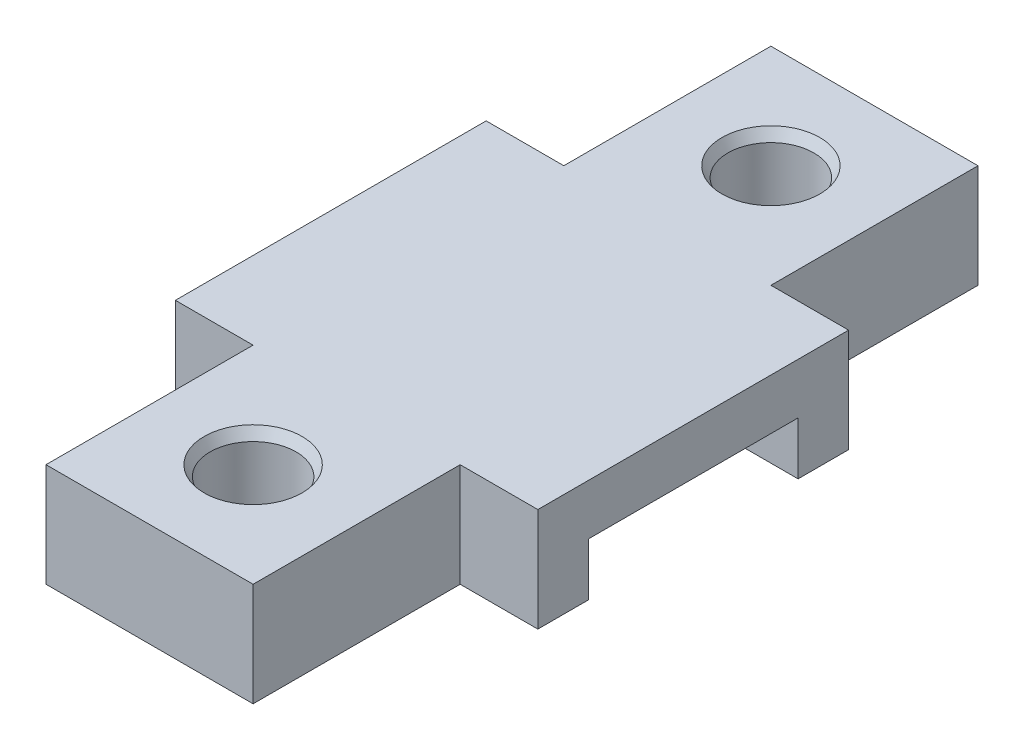
ISO-10303-21;
HEADER;
FILE_DESCRIPTION(('STEP AP214'),'2;1');
FILE_NAME('part.step','',(''),(''),'','','');
FILE_SCHEMA(('AUTOMOTIVE_DESIGN { 1 0 10303 214 1 1 1 1 }'));
ENDSEC;
DATA;
#1=APPLICATION_CONTEXT('core data for automotive mechanical design processes');
#2=APPLICATION_PROTOCOL_DEFINITION('international standard','automotive_design',2000,#1);
#3=PRODUCT_CONTEXT('',#1,'mechanical');
#4=PRODUCT('Part','Part','',(#3));
#5=PRODUCT_RELATED_PRODUCT_CATEGORY('part','',(#4));
#6=PRODUCT_DEFINITION_FORMATION('','',#4);
#7=PRODUCT_DEFINITION_CONTEXT('part definition',#1,'design');
#8=PRODUCT_DEFINITION('design','',#6,#7);
#9=PRODUCT_DEFINITION_SHAPE('','',#8);
#10=(LENGTH_UNIT() NAMED_UNIT(*) SI_UNIT(.MILLI.,.METRE.));
#11=(NAMED_UNIT(*) PLANE_ANGLE_UNIT() SI_UNIT($,.RADIAN.));
#12=(NAMED_UNIT(*) SI_UNIT($,.STERADIAN.) SOLID_ANGLE_UNIT());
#13=UNCERTAINTY_MEASURE_WITH_UNIT(LENGTH_MEASURE(1.E-05),#10,'distance_accuracy_value','');
#14=(GEOMETRIC_REPRESENTATION_CONTEXT(3) GLOBAL_UNCERTAINTY_ASSIGNED_CONTEXT((#13)) GLOBAL_UNIT_ASSIGNED_CONTEXT((#10,
#11,#12)) REPRESENTATION_CONTEXT('',''));
#15=CARTESIAN_POINT('',(0.,0.,0.));
#16=DIRECTION('',(0.,0.,1.));
#17=DIRECTION('',(1.,0.,0.));
#18=AXIS2_PLACEMENT_3D('',#15,#16,#17);
#19=CARTESIAN_POINT('',(-10.,10.,35.));
#20=DIRECTION('',(1.,0.,0.));
#21=DIRECTION('',(0.,0.,-1.));
#22=AXIS2_PLACEMENT_3D('',#19,#20,#21);
#23=PLANE('',#22);
#24=DIRECTION('',(0.,0.,1.));
#25=VECTOR('',#24,1.);
#26=CARTESIAN_POINT('',(-10.,10.,35.));
#27=LINE('',#26,#25);
#28=CARTESIAN_POINT('',(-10.,10.,15.005));
#29=VERTEX_POINT('',#28);
#30=CARTESIAN_POINT('',(-10.,10.,35.));
#31=VERTEX_POINT('',#30);
#32=EDGE_CURVE('E249',#29,#31,#27,.T.);
#33=ORIENTED_EDGE('',*,*,#32,.F.);
#34=DIRECTION('',(0.,-1.,0.));
#35=VECTOR('',#34,1.);
#36=CARTESIAN_POINT('',(-10.,10.,15.005));
#37=LINE('',#36,#35);
#38=CARTESIAN_POINT('',(-10.,0.,15.005));
#39=VERTEX_POINT('',#38);
#40=EDGE_CURVE('E50',#29,#39,#37,.T.);
#41=ORIENTED_EDGE('',*,*,#40,.T.);
#42=DIRECTION('',(0.,0.,1.));
#43=VECTOR('',#42,1.);
#44=CARTESIAN_POINT('',(-10.,0.,35.));
#45=LINE('',#44,#43);
#46=CARTESIAN_POINT('',(-10.,0.,35.));
#47=VERTEX_POINT('',#46);
#48=EDGE_CURVE('E159',#39,#47,#45,.T.);
#49=ORIENTED_EDGE('',*,*,#48,.T.);
#50=DIRECTION('',(0.,-1.,0.));
#51=VECTOR('',#50,1.);
#52=CARTESIAN_POINT('',(-10.,10.,35.));
#53=LINE('',#52,#51);
#54=EDGE_CURVE('E273',#31,#47,#53,.T.);
#55=ORIENTED_EDGE('',*,*,#54,.F.);
#56=EDGE_LOOP('',(#33,#41,#49,#55));
#57=FACE_BOUND('',#56,.T.);
#58=ADVANCED_FACE('F35',(#57),#23,.F.);
#59=CARTESIAN_POINT('',(9.99999999999999,10.,35.));
#60=DIRECTION('',(-1.,0.,0.));
#61=DIRECTION('',(0.,0.,1.));
#62=AXIS2_PLACEMENT_3D('',#59,#60,#61);
#63=PLANE('',#62);
#64=DIRECTION('',(0.,0.,-1.));
#65=VECTOR('',#64,1.);
#66=CARTESIAN_POINT('',(9.99999999999999,0.,35.));
#67=LINE('',#66,#65);
#68=CARTESIAN_POINT('',(9.99999999999999,0.,35.));
#69=VERTEX_POINT('',#68);
#70=CARTESIAN_POINT('',(9.99999999999999,0.,15.005));
#71=VERTEX_POINT('',#70);
#72=EDGE_CURVE('E58',#69,#71,#67,.T.);
#73=ORIENTED_EDGE('',*,*,#72,.T.);
#74=DIRECTION('',(0.,1.,0.));
#75=VECTOR('',#74,1.);
#76=CARTESIAN_POINT('',(9.99999999999999,10.,15.005));
#77=LINE('',#76,#75);
#78=CARTESIAN_POINT('',(9.99999999999999,10.,15.005));
#79=VERTEX_POINT('',#78);
#80=EDGE_CURVE('E231',#71,#79,#77,.T.);
#81=ORIENTED_EDGE('',*,*,#80,.T.);
#82=DIRECTION('',(0.,0.,-1.));
#83=VECTOR('',#82,1.);
#84=CARTESIAN_POINT('',(9.99999999999999,10.,35.));
#85=LINE('',#84,#83);
#86=CARTESIAN_POINT('',(9.99999999999999,10.,35.));
#87=VERTEX_POINT('',#86);
#88=EDGE_CURVE('E252',#87,#79,#85,.T.);
#89=ORIENTED_EDGE('',*,*,#88,.F.);
#90=DIRECTION('',(0.,-1.,0.));
#91=VECTOR('',#90,1.);
#92=CARTESIAN_POINT('',(9.99999999999999,10.,35.));
#93=LINE('',#92,#91);
#94=EDGE_CURVE('E271',#87,#69,#93,.T.);
#95=ORIENTED_EDGE('',*,*,#94,.T.);
#96=EDGE_LOOP('',(#73,#81,#89,#95));
#97=FACE_BOUND('',#96,.T.);
#98=ADVANCED_FACE('F345',(#97),#63,.F.);
#99=CARTESIAN_POINT('',(0.,0.,0.));
#100=DIRECTION('',(0.,1.,0.));
#101=DIRECTION('',(0.,0.,1.));
#102=AXIS2_PLACEMENT_3D('',#99,#100,#101);
#103=PLANE('',#102);
#104=CARTESIAN_POINT('',(0.,0.,25.));
#105=DIRECTION('',(0.,-1.,0.));
#106=DIRECTION('',(0.,0.,-1.));
#107=AXIS2_PLACEMENT_3D('',#104,#105,#106);
#108=CIRCLE('',#107,4.15);
#109=CARTESIAN_POINT('',(0.,0.,20.85));
#110=VERTEX_POINT('',#109);
#111=EDGE_CURVE('E237',#110,#110,#108,.T.);
#112=ORIENTED_EDGE('',*,*,#111,.F.);
#113=EDGE_LOOP('',(#112));
#114=FACE_BOUND('',#113,.T.);
#115=ORIENTED_EDGE('',*,*,#48,.F.);
#116=DIRECTION('',(1.,0.,0.));
#117=VECTOR('',#116,1.);
#118=CARTESIAN_POINT('',(-17.5,0.,15.005));
#119=LINE('',#118,#117);
#120=CARTESIAN_POINT('',(-17.5,0.,15.005));
#121=VERTEX_POINT('',#120);
#122=EDGE_CURVE('E212',#121,#39,#119,.T.);
#123=ORIENTED_EDGE('',*,*,#122,.F.);
#124=DIRECTION('',(0.,0.,-1.));
#125=VECTOR('',#124,1.);
#126=CARTESIAN_POINT('',(-17.5,0.,10.125));
#127=LINE('',#126,#125);
#128=CARTESIAN_POINT('',(-17.5,0.,10.125));
#129=VERTEX_POINT('',#128);
#130=EDGE_CURVE('E208',#121,#129,#127,.T.);
#131=ORIENTED_EDGE('',*,*,#130,.T.);
#132=DIRECTION('',(1.,0.,0.));
#133=VECTOR('',#132,1.);
#134=CARTESIAN_POINT('',(-10.,0.,10.125));
#135=LINE('',#134,#133);
#136=CARTESIAN_POINT('',(17.5,0.,10.125));
#137=VERTEX_POINT('',#136);
#138=EDGE_CURVE('E239',#129,#137,#135,.T.);
#139=ORIENTED_EDGE('',*,*,#138,.T.);
#140=DIRECTION('',(0.,0.,-1.));
#141=VECTOR('',#140,1.);
#142=CARTESIAN_POINT('',(17.5,0.,10.125));
#143=LINE('',#142,#141);
#144=CARTESIAN_POINT('',(17.5,0.,15.005));
#145=VERTEX_POINT('',#144);
#146=EDGE_CURVE('E174',#145,#137,#143,.T.);
#147=ORIENTED_EDGE('',*,*,#146,.F.);
#148=EDGE_CURVE('E216',#71,#145,#119,.T.);
#149=ORIENTED_EDGE('',*,*,#148,.F.);
#150=ORIENTED_EDGE('',*,*,#72,.F.);
#151=DIRECTION('',(1.,0.,0.));
#152=VECTOR('',#151,1.);
#153=CARTESIAN_POINT('',(9.99999999999999,0.,35.));
#154=LINE('',#153,#152);
#155=EDGE_CURVE('E260',#47,#69,#154,.T.);
#156=ORIENTED_EDGE('',*,*,#155,.F.);
#157=EDGE_LOOP('',(#115,#123,#131,#139,#147,#149,#150,#156));
#158=FACE_BOUND('',#157,.T.);
#159=ADVANCED_FACE('F334',(#114,#158),#103,.F.);
#160=CARTESIAN_POINT('',(-10.,0.,-35.));
#161=VERTEX_POINT('',#160);
#162=CARTESIAN_POINT('',(-10.,0.,-15.005));
#163=VERTEX_POINT('',#162);
#164=EDGE_CURVE('E258',#161,#163,#45,.T.);
#165=ORIENTED_EDGE('',*,*,#164,.T.);
#166=DIRECTION('',(0.,1.,0.));
#167=VECTOR('',#166,1.);
#168=CARTESIAN_POINT('',(-10.,10.,-15.005));
#169=LINE('',#168,#167);
#170=CARTESIAN_POINT('',(-10.,10.,-15.005));
#171=VERTEX_POINT('',#170);
#172=EDGE_CURVE('E229',#163,#171,#169,.T.);
#173=ORIENTED_EDGE('',*,*,#172,.T.);
#174=CARTESIAN_POINT('',(-10.,10.,-35.));
#175=VERTEX_POINT('',#174);
#176=EDGE_CURVE('E245',#175,#171,#27,.T.);
#177=ORIENTED_EDGE('',*,*,#176,.F.);
#178=DIRECTION('',(0.,-1.,0.));
#179=VECTOR('',#178,1.);
#180=CARTESIAN_POINT('',(-10.,10.,-35.));
#181=LINE('',#180,#179);
#182=EDGE_CURVE('E257',#175,#161,#181,.T.);
#183=ORIENTED_EDGE('',*,*,#182,.T.);
#184=EDGE_LOOP('',(#165,#173,#177,#183));
#185=FACE_BOUND('',#184,.T.);
#186=ADVANCED_FACE('F353',(#185),#23,.F.);
#187=CARTESIAN_POINT('',(9.99999999999999,10.,35.));
#188=DIRECTION('',(0.,0.,-1.));
#189=DIRECTION('',(-1.,0.,0.));
#190=AXIS2_PLACEMENT_3D('',#187,#188,#189);
#191=PLANE('',#190);
#192=ORIENTED_EDGE('',*,*,#155,.T.);
#193=ORIENTED_EDGE('',*,*,#94,.F.);
#194=DIRECTION('',(1.,0.,0.));
#195=VECTOR('',#194,1.);
#196=CARTESIAN_POINT('',(9.99999999999999,10.,35.));
#197=LINE('',#196,#195);
#198=EDGE_CURVE('E248',#31,#87,#197,.T.);
#199=ORIENTED_EDGE('',*,*,#198,.F.);
#200=ORIENTED_EDGE('',*,*,#54,.T.);
#201=EDGE_LOOP('',(#192,#193,#199,#200));
#202=FACE_BOUND('',#201,.T.);
#203=ADVANCED_FACE('F342',(#202),#191,.F.);
#204=CARTESIAN_POINT('',(9.99999999999999,10.,-15.005));
#205=VERTEX_POINT('',#204);
#206=CARTESIAN_POINT('',(9.99999999999999,10.,-35.));
#207=VERTEX_POINT('',#206);
#208=EDGE_CURVE('E251',#205,#207,#85,.T.);
#209=ORIENTED_EDGE('',*,*,#208,.F.);
#210=DIRECTION('',(0.,-1.,0.));
#211=VECTOR('',#210,1.);
#212=CARTESIAN_POINT('',(9.99999999999999,10.,-15.005));
#213=LINE('',#212,#211);
#214=CARTESIAN_POINT('',(9.99999999999999,0.,-15.005));
#215=VERTEX_POINT('',#214);
#216=EDGE_CURVE('E215',#205,#215,#213,.T.);
#217=ORIENTED_EDGE('',*,*,#216,.T.);
#218=CARTESIAN_POINT('',(9.99999999999999,0.,-35.));
#219=VERTEX_POINT('',#218);
#220=EDGE_CURVE('E262',#215,#219,#67,.T.);
#221=ORIENTED_EDGE('',*,*,#220,.T.);
#222=DIRECTION('',(0.,-1.,0.));
#223=VECTOR('',#222,1.);
#224=CARTESIAN_POINT('',(9.99999999999999,10.,-35.));
#225=LINE('',#224,#223);
#226=EDGE_CURVE('E268',#207,#219,#225,.T.);
#227=ORIENTED_EDGE('',*,*,#226,.F.);
#228=EDGE_LOOP('',(#209,#217,#221,#227));
#229=FACE_BOUND('',#228,.T.);
#230=ADVANCED_FACE('F348',(#229),#63,.F.);
#231=CARTESIAN_POINT('',(9.99999999999999,10.,-35.));
#232=DIRECTION('',(0.,0.,1.));
#233=DIRECTION('',(1.,0.,0.));
#234=AXIS2_PLACEMENT_3D('',#231,#232,#233);
#235=PLANE('',#234);
#236=DIRECTION('',(-1.,0.,0.));
#237=VECTOR('',#236,1.);
#238=CARTESIAN_POINT('',(9.99999999999999,0.,-35.));
#239=LINE('',#238,#237);
#240=EDGE_CURVE('E264',#219,#161,#239,.T.);
#241=ORIENTED_EDGE('',*,*,#240,.T.);
#242=ORIENTED_EDGE('',*,*,#182,.F.);
#243=DIRECTION('',(-1.,0.,0.));
#244=VECTOR('',#243,1.);
#245=CARTESIAN_POINT('',(9.99999999999999,10.,-35.));
#246=LINE('',#245,#244);
#247=EDGE_CURVE('E255',#207,#175,#246,.T.);
#248=ORIENTED_EDGE('',*,*,#247,.F.);
#249=ORIENTED_EDGE('',*,*,#226,.T.);
#250=EDGE_LOOP('',(#241,#242,#248,#249));
#251=FACE_BOUND('',#250,.T.);
#252=ADVANCED_FACE('F297',(#251),#235,.F.);
#253=CARTESIAN_POINT('',(0.,10.,0.));
#254=DIRECTION('',(0.,1.,0.));
#255=DIRECTION('',(0.,0.,1.));
#256=AXIS2_PLACEMENT_3D('',#253,#254,#255);
#257=PLANE('',#256);
#258=CARTESIAN_POINT('',(0.,10.,-25.));
#259=DIRECTION('',(0.,1.,0.));
#260=DIRECTION('',(0.,0.,1.));
#261=AXIS2_PLACEMENT_3D('',#258,#259,#260);
#262=CIRCLE('',#261,4.72735026918963);
#263=CARTESIAN_POINT('',(0.,10.,-20.2726497308104));
#264=VERTEX_POINT('',#263);
#265=EDGE_CURVE('E279',#264,#264,#262,.F.);
#266=ORIENTED_EDGE('',*,*,#265,.T.);
#267=EDGE_LOOP('',(#266));
#268=FACE_BOUND('',#267,.T.);
#269=CARTESIAN_POINT('',(0.,10.,25.));
#270=DIRECTION('',(0.,1.,0.));
#271=DIRECTION('',(0.,0.,1.));
#272=AXIS2_PLACEMENT_3D('',#269,#270,#271);
#273=CIRCLE('',#272,4.72735026918963);
#274=CARTESIAN_POINT('',(0.,10.,29.7273502691896));
#275=VERTEX_POINT('',#274);
#276=EDGE_CURVE('E276',#275,#275,#273,.F.);
#277=ORIENTED_EDGE('',*,*,#276,.T.);
#278=EDGE_LOOP('',(#277));
#279=FACE_BOUND('',#278,.T.);
#280=ORIENTED_EDGE('',*,*,#176,.T.);
#281=DIRECTION('',(1.,0.,0.));
#282=VECTOR('',#281,1.);
#283=CARTESIAN_POINT('',(-17.5,10.,-15.005));
#284=LINE('',#283,#282);
#285=CARTESIAN_POINT('',(-17.5,10.,-15.005));
#286=VERTEX_POINT('',#285);
#287=EDGE_CURVE('E221',#286,#171,#284,.T.);
#288=ORIENTED_EDGE('',*,*,#287,.F.);
#289=DIRECTION('',(0.,0.,1.));
#290=VECTOR('',#289,1.);
#291=CARTESIAN_POINT('',(-17.5,10.,15.005));
#292=LINE('',#291,#290);
#293=CARTESIAN_POINT('',(-17.5,10.,15.005));
#294=VERTEX_POINT('',#293);
#295=EDGE_CURVE('E202',#286,#294,#292,.T.);
#296=ORIENTED_EDGE('',*,*,#295,.T.);
#297=DIRECTION('',(1.,0.,0.));
#298=VECTOR('',#297,1.);
#299=CARTESIAN_POINT('',(-17.5,10.,15.005));
#300=LINE('',#299,#298);
#301=EDGE_CURVE('E217',#294,#29,#300,.T.);
#302=ORIENTED_EDGE('',*,*,#301,.T.);
#303=ORIENTED_EDGE('',*,*,#32,.T.);
#304=ORIENTED_EDGE('',*,*,#198,.T.);
#305=ORIENTED_EDGE('',*,*,#88,.T.);
#306=CARTESIAN_POINT('',(17.5,10.,15.005));
#307=VERTEX_POINT('',#306);
#308=EDGE_CURVE('E220',#79,#307,#300,.T.);
#309=ORIENTED_EDGE('',*,*,#308,.T.);
#310=DIRECTION('',(0.,0.,1.));
#311=VECTOR('',#310,1.);
#312=CARTESIAN_POINT('',(17.5,10.,15.005));
#313=LINE('',#312,#311);
#314=CARTESIAN_POINT('',(17.5,10.,-15.005));
#315=VERTEX_POINT('',#314);
#316=EDGE_CURVE('E184',#315,#307,#313,.T.);
#317=ORIENTED_EDGE('',*,*,#316,.F.);
#318=EDGE_CURVE('E224',#205,#315,#284,.T.);
#319=ORIENTED_EDGE('',*,*,#318,.F.);
#320=ORIENTED_EDGE('',*,*,#208,.T.);
#321=ORIENTED_EDGE('',*,*,#247,.T.);
#322=EDGE_LOOP('',(#280,#288,#296,#302,#303,#304,#305,#309,#317,#319,#320,#321));
#323=FACE_BOUND('',#322,.T.);
#324=ADVANCED_FACE('F293',(#268,#279,#323),#257,.T.);
#325=CARTESIAN_POINT('',(0.,0.,-25.));
#326=DIRECTION('',(0.,-1.,0.));
#327=DIRECTION('',(0.,0.,-1.));
#328=AXIS2_PLACEMENT_3D('',#325,#326,#327);
#329=CIRCLE('',#328,4.15);
#330=CARTESIAN_POINT('',(0.,0.,-29.15));
#331=VERTEX_POINT('',#330);
#332=EDGE_CURVE('E234',#331,#331,#329,.T.);
#333=ORIENTED_EDGE('',*,*,#332,.F.);
#334=EDGE_LOOP('',(#333));
#335=FACE_BOUND('',#334,.T.);
#336=ORIENTED_EDGE('',*,*,#220,.F.);
#337=DIRECTION('',(1.,0.,0.));
#338=VECTOR('',#337,1.);
#339=CARTESIAN_POINT('',(-17.5,0.,-15.005));
#340=LINE('',#339,#338);
#341=CARTESIAN_POINT('',(17.5,0.,-15.005));
#342=VERTEX_POINT('',#341);
#343=EDGE_CURVE('E211',#215,#342,#340,.T.);
#344=ORIENTED_EDGE('',*,*,#343,.T.);
#345=DIRECTION('',(0.,0.,-1.));
#346=VECTOR('',#345,1.);
#347=CARTESIAN_POINT('',(17.5,0.,-15.005));
#348=LINE('',#347,#346);
#349=CARTESIAN_POINT('',(17.5,0.,-10.125));
#350=VERTEX_POINT('',#349);
#351=EDGE_CURVE('E178',#350,#342,#348,.T.);
#352=ORIENTED_EDGE('',*,*,#351,.F.);
#353=DIRECTION('',(1.,0.,0.));
#354=VECTOR('',#353,1.);
#355=CARTESIAN_POINT('',(-10.,0.,-10.125));
#356=LINE('',#355,#354);
#357=CARTESIAN_POINT('',(-17.5,0.,-10.125));
#358=VERTEX_POINT('',#357);
#359=EDGE_CURVE('E242',#358,#350,#356,.T.);
#360=ORIENTED_EDGE('',*,*,#359,.F.);
#361=DIRECTION('',(0.,0.,-1.));
#362=VECTOR('',#361,1.);
#363=CARTESIAN_POINT('',(-17.5,0.,-15.005));
#364=LINE('',#363,#362);
#365=CARTESIAN_POINT('',(-17.5,0.,-15.005));
#366=VERTEX_POINT('',#365);
#367=EDGE_CURVE('E196',#358,#366,#364,.T.);
#368=ORIENTED_EDGE('',*,*,#367,.T.);
#369=EDGE_CURVE('E225',#366,#163,#340,.T.);
#370=ORIENTED_EDGE('',*,*,#369,.T.);
#371=ORIENTED_EDGE('',*,*,#164,.F.);
#372=ORIENTED_EDGE('',*,*,#240,.F.);
#373=EDGE_LOOP('',(#336,#344,#352,#360,#368,#370,#371,#372));
#374=FACE_BOUND('',#373,.T.);
#375=ADVANCED_FACE('F296',(#335,#374),#103,.F.);
#376=CARTESIAN_POINT('',(-10.,5.10000000000001,-10.125));
#377=DIRECTION('',(0.,1.,0.));
#378=DIRECTION('',(0.,0.,1.));
#379=AXIS2_PLACEMENT_3D('',#376,#377,#378);
#380=PLANE('',#379);
#381=DIRECTION('',(1.,0.,0.));
#382=VECTOR('',#381,1.);
#383=CARTESIAN_POINT('',(-10.,5.1,10.125));
#384=LINE('',#383,#382);
#385=CARTESIAN_POINT('',(-17.5,5.1,10.125));
#386=VERTEX_POINT('',#385);
#387=CARTESIAN_POINT('',(17.5,5.1,10.125));
#388=VERTEX_POINT('',#387);
#389=EDGE_CURVE('E149',#386,#388,#384,.T.);
#390=ORIENTED_EDGE('',*,*,#389,.F.);
#391=DIRECTION('',(0.,0.,-1.));
#392=VECTOR('',#391,1.);
#393=CARTESIAN_POINT('',(-17.5,5.10000000000001,-10.125));
#394=LINE('',#393,#392);
#395=CARTESIAN_POINT('',(-17.5,5.10000000000001,-10.125));
#396=VERTEX_POINT('',#395);
#397=EDGE_CURVE('E191',#386,#396,#394,.T.);
#398=ORIENTED_EDGE('',*,*,#397,.T.);
#399=DIRECTION('',(1.,0.,0.));
#400=VECTOR('',#399,1.);
#401=CARTESIAN_POINT('',(-10.,5.10000000000001,-10.125));
#402=LINE('',#401,#400);
#403=CARTESIAN_POINT('',(17.5,5.10000000000001,-10.125));
#404=VERTEX_POINT('',#403);
#405=EDGE_CURVE('E160',#396,#404,#402,.T.);
#406=ORIENTED_EDGE('',*,*,#405,.T.);
#407=DIRECTION('',(0.,0.,-1.));
#408=VECTOR('',#407,1.);
#409=CARTESIAN_POINT('',(17.5,5.10000000000001,-10.125));
#410=LINE('',#409,#408);
#411=EDGE_CURVE('E163',#388,#404,#410,.T.);
#412=ORIENTED_EDGE('',*,*,#411,.F.);
#413=EDGE_LOOP('',(#390,#398,#406,#412));
#414=FACE_BOUND('',#413,.T.);
#415=ADVANCED_FACE('F164',(#414),#380,.F.);
#416=CARTESIAN_POINT('',(-10.,5.1,10.125));
#417=DIRECTION('',(0.,0.,1.));
#418=DIRECTION('',(1.,0.,0.));
#419=AXIS2_PLACEMENT_3D('',#416,#417,#418);
#420=PLANE('',#419);
#421=ORIENTED_EDGE('',*,*,#138,.F.);
#422=DIRECTION('',(0.,1.,0.));
#423=VECTOR('',#422,1.);
#424=CARTESIAN_POINT('',(-17.5,5.1,10.125));
#425=LINE('',#424,#423);
#426=EDGE_CURVE('E155',#129,#386,#425,.T.);
#427=ORIENTED_EDGE('',*,*,#426,.T.);
#428=ORIENTED_EDGE('',*,*,#389,.T.);
#429=DIRECTION('',(0.,1.,0.));
#430=VECTOR('',#429,1.);
#431=CARTESIAN_POINT('',(17.5,5.1,10.125));
#432=LINE('',#431,#430);
#433=EDGE_CURVE('E153',#137,#388,#432,.T.);
#434=ORIENTED_EDGE('',*,*,#433,.F.);
#435=EDGE_LOOP('',(#421,#427,#428,#434));
#436=FACE_BOUND('',#435,.T.);
#437=ADVANCED_FACE('F151',(#436),#420,.F.);
#438=CARTESIAN_POINT('',(-10.,5.10000000000001,-10.125));
#439=DIRECTION('',(0.,0.,-1.));
#440=DIRECTION('',(0.,1.,0.));
#441=AXIS2_PLACEMENT_3D('',#438,#439,#440);
#442=PLANE('',#441);
#443=ORIENTED_EDGE('',*,*,#405,.F.);
#444=DIRECTION('',(0.,-1.,0.));
#445=VECTOR('',#444,1.);
#446=CARTESIAN_POINT('',(-17.5,0.,-10.125));
#447=LINE('',#446,#445);
#448=EDGE_CURVE('E193',#396,#358,#447,.T.);
#449=ORIENTED_EDGE('',*,*,#448,.T.);
#450=ORIENTED_EDGE('',*,*,#359,.T.);
#451=DIRECTION('',(0.,-1.,0.));
#452=VECTOR('',#451,1.);
#453=CARTESIAN_POINT('',(17.5,0.,-10.125));
#454=LINE('',#453,#452);
#455=EDGE_CURVE('E168',#404,#350,#454,.T.);
#456=ORIENTED_EDGE('',*,*,#455,.F.);
#457=EDGE_LOOP('',(#443,#449,#450,#456));
#458=FACE_BOUND('',#457,.T.);
#459=ADVANCED_FACE('F319',(#458),#442,.F.);
#460=CARTESIAN_POINT('',(0.,10.,25.));
#461=DIRECTION('',(0.,-1.,0.));
#462=DIRECTION('',(0.,0.,-1.));
#463=AXIS2_PLACEMENT_3D('',#460,#461,#462);
#464=CYLINDRICAL_SURFACE('',#463,4.15);
#465=CARTESIAN_POINT('',(0.,8.99999999999999,25.));
#466=DIRECTION('',(0.,1.,0.));
#467=DIRECTION('',(0.,0.,1.));
#468=AXIS2_PLACEMENT_3D('',#465,#466,#467);
#469=CIRCLE('',#468,4.15);
#470=CARTESIAN_POINT('',(0.,8.99999999999999,29.15));
#471=VERTEX_POINT('',#470);
#472=EDGE_CURVE('E11',#471,#471,#469,.T.);
#473=ORIENTED_EDGE('',*,*,#472,.T.);
#474=EDGE_LOOP('',(#473));
#475=FACE_BOUND('',#474,.T.);
#476=ORIENTED_EDGE('',*,*,#111,.T.);
#477=EDGE_LOOP('',(#476));
#478=FACE_BOUND('',#477,.T.);
#479=ADVANCED_FACE('F452',(#475,#478),#464,.F.);
#480=CARTESIAN_POINT('',(0.,10.,-25.));
#481=DIRECTION('',(0.,-1.,0.));
#482=DIRECTION('',(0.,0.,-1.));
#483=AXIS2_PLACEMENT_3D('',#480,#481,#482);
#484=CYLINDRICAL_SURFACE('',#483,4.15);
#485=CARTESIAN_POINT('',(0.,8.99999999999999,-25.));
#486=DIRECTION('',(0.,1.,0.));
#487=DIRECTION('',(0.,0.,1.));
#488=AXIS2_PLACEMENT_3D('',#485,#486,#487);
#489=CIRCLE('',#488,4.15);
#490=CARTESIAN_POINT('',(0.,8.99999999999999,-20.85));
#491=VERTEX_POINT('',#490);
#492=EDGE_CURVE('E43',#491,#491,#489,.T.);
#493=ORIENTED_EDGE('',*,*,#492,.T.);
#494=EDGE_LOOP('',(#493));
#495=FACE_BOUND('',#494,.T.);
#496=ORIENTED_EDGE('',*,*,#332,.T.);
#497=EDGE_LOOP('',(#496));
#498=FACE_BOUND('',#497,.T.);
#499=ADVANCED_FACE('F284',(#495,#498),#484,.F.);
#500=CARTESIAN_POINT('',(17.5,0.,0.));
#501=DIRECTION('',(-1.,0.,0.));
#502=DIRECTION('',(0.,0.,1.));
#503=AXIS2_PLACEMENT_3D('',#500,#501,#502);
#504=PLANE('',#503);
#505=ORIENTED_EDGE('',*,*,#433,.T.);
#506=ORIENTED_EDGE('',*,*,#411,.T.);
#507=ORIENTED_EDGE('',*,*,#455,.T.);
#508=ORIENTED_EDGE('',*,*,#351,.T.);
#509=DIRECTION('',(0.,1.,0.));
#510=VECTOR('',#509,1.);
#511=CARTESIAN_POINT('',(17.5,10.,-15.005));
#512=LINE('',#511,#510);
#513=EDGE_CURVE('E181',#342,#315,#512,.T.);
#514=ORIENTED_EDGE('',*,*,#513,.T.);
#515=ORIENTED_EDGE('',*,*,#316,.T.);
#516=DIRECTION('',(0.,-1.,0.));
#517=VECTOR('',#516,1.);
#518=CARTESIAN_POINT('',(17.5,0.,15.005));
#519=LINE('',#518,#517);
#520=EDGE_CURVE('E187',#307,#145,#519,.T.);
#521=ORIENTED_EDGE('',*,*,#520,.T.);
#522=ORIENTED_EDGE('',*,*,#146,.T.);
#523=EDGE_LOOP('',(#505,#506,#507,#508,#514,#515,#521,#522));
#524=FACE_BOUND('',#523,.T.);
#525=ADVANCED_FACE('F171',(#524),#504,.F.);
#526=CARTESIAN_POINT('',(-17.5,10.,-15.005));
#527=DIRECTION('',(0.,0.,-1.));
#528=DIRECTION('',(-1.,0.,0.));
#529=AXIS2_PLACEMENT_3D('',#526,#527,#528);
#530=PLANE('',#529);
#531=ORIENTED_EDGE('',*,*,#216,.F.);
#532=ORIENTED_EDGE('',*,*,#318,.T.);
#533=ORIENTED_EDGE('',*,*,#513,.F.);
#534=ORIENTED_EDGE('',*,*,#343,.F.);
#535=EDGE_LOOP('',(#531,#532,#533,#534));
#536=FACE_BOUND('',#535,.T.);
#537=ADVANCED_FACE('F325',(#536),#530,.T.);
#538=CARTESIAN_POINT('',(-17.5,0.,15.005));
#539=DIRECTION('',(0.,0.,1.));
#540=DIRECTION('',(1.,0.,0.));
#541=AXIS2_PLACEMENT_3D('',#538,#539,#540);
#542=PLANE('',#541);
#543=ORIENTED_EDGE('',*,*,#80,.F.);
#544=ORIENTED_EDGE('',*,*,#148,.T.);
#545=ORIENTED_EDGE('',*,*,#520,.F.);
#546=ORIENTED_EDGE('',*,*,#308,.F.);
#547=EDGE_LOOP('',(#543,#544,#545,#546));
#548=FACE_BOUND('',#547,.T.);
#549=ADVANCED_FACE('F331',(#548),#542,.T.);
#550=ORIENTED_EDGE('',*,*,#40,.F.);
#551=ORIENTED_EDGE('',*,*,#301,.F.);
#552=DIRECTION('',(0.,-1.,0.));
#553=VECTOR('',#552,1.);
#554=CARTESIAN_POINT('',(-17.5,0.,15.005));
#555=LINE('',#554,#553);
#556=EDGE_CURVE('E205',#294,#121,#555,.T.);
#557=ORIENTED_EDGE('',*,*,#556,.T.);
#558=ORIENTED_EDGE('',*,*,#122,.T.);
#559=EDGE_LOOP('',(#550,#551,#557,#558));
#560=FACE_BOUND('',#559,.T.);
#561=ADVANCED_FACE('F339',(#560),#542,.T.);
#562=ORIENTED_EDGE('',*,*,#172,.F.);
#563=ORIENTED_EDGE('',*,*,#369,.F.);
#564=DIRECTION('',(0.,1.,0.));
#565=VECTOR('',#564,1.);
#566=CARTESIAN_POINT('',(-17.5,10.,-15.005));
#567=LINE('',#566,#565);
#568=EDGE_CURVE('E199',#366,#286,#567,.T.);
#569=ORIENTED_EDGE('',*,*,#568,.T.);
#570=ORIENTED_EDGE('',*,*,#287,.T.);
#571=EDGE_LOOP('',(#562,#563,#569,#570));
#572=FACE_BOUND('',#571,.T.);
#573=ADVANCED_FACE('F308',(#572),#530,.T.);
#574=CARTESIAN_POINT('',(-17.5,0.,0.));
#575=DIRECTION('',(-1.,0.,0.));
#576=DIRECTION('',(0.,0.,1.));
#577=AXIS2_PLACEMENT_3D('',#574,#575,#576);
#578=PLANE('',#577);
#579=ORIENTED_EDGE('',*,*,#426,.F.);
#580=ORIENTED_EDGE('',*,*,#130,.F.);
#581=ORIENTED_EDGE('',*,*,#556,.F.);
#582=ORIENTED_EDGE('',*,*,#295,.F.);
#583=ORIENTED_EDGE('',*,*,#568,.F.);
#584=ORIENTED_EDGE('',*,*,#367,.F.);
#585=ORIENTED_EDGE('',*,*,#448,.F.);
#586=ORIENTED_EDGE('',*,*,#397,.F.);
#587=EDGE_LOOP('',(#579,#580,#581,#582,#583,#584,#585,#586));
#588=FACE_BOUND('',#587,.T.);
#589=ADVANCED_FACE('F290',(#588),#578,.T.);
#590=CARTESIAN_POINT('',(0.,10.,-25.));
#591=DIRECTION('',(0.,1.,0.));
#592=DIRECTION('',(0.,0.,1.));
#593=AXIS2_PLACEMENT_3D('',#590,#591,#592);
#594=CONICAL_SURFACE('',#593,4.72735026918963,0.523598775598296);
#595=ORIENTED_EDGE('',*,*,#492,.F.);
#596=EDGE_LOOP('',(#595));
#597=FACE_BOUND('',#596,.T.);
#598=ORIENTED_EDGE('',*,*,#265,.F.);
#599=EDGE_LOOP('',(#598));
#600=FACE_BOUND('',#599,.T.);
#601=ADVANCED_FACE('F287',(#597,#600),#594,.F.);
#602=CARTESIAN_POINT('',(0.,10.,25.));
#603=DIRECTION('',(0.,1.,0.));
#604=DIRECTION('',(0.,0.,1.));
#605=AXIS2_PLACEMENT_3D('',#602,#603,#604);
#606=CONICAL_SURFACE('',#605,4.72735026918963,0.523598775598296);
#607=ORIENTED_EDGE('',*,*,#472,.F.);
#608=EDGE_LOOP('',(#607));
#609=FACE_BOUND('',#608,.T.);
#610=ORIENTED_EDGE('',*,*,#276,.F.);
#611=EDGE_LOOP('',(#610));
#612=FACE_BOUND('',#611,.T.);
#613=ADVANCED_FACE('F37',(#609,#612),#606,.F.);
#614=CLOSED_SHELL('',(#58,#98,#159,#186,#203,#230,#252,#324,#375,#415,#437,#459,#479,#499,#525,
#537,#549,#561,#573,#589,#601,#613));
#615=MANIFOLD_SOLID_BREP('B2',#614);
#616=ADVANCED_BREP_SHAPE_REPRESENTATION('',(#18,#615),#14);
#617=SHAPE_DEFINITION_REPRESENTATION(#9,#616);
ENDSEC;
END-ISO-10303-21;
